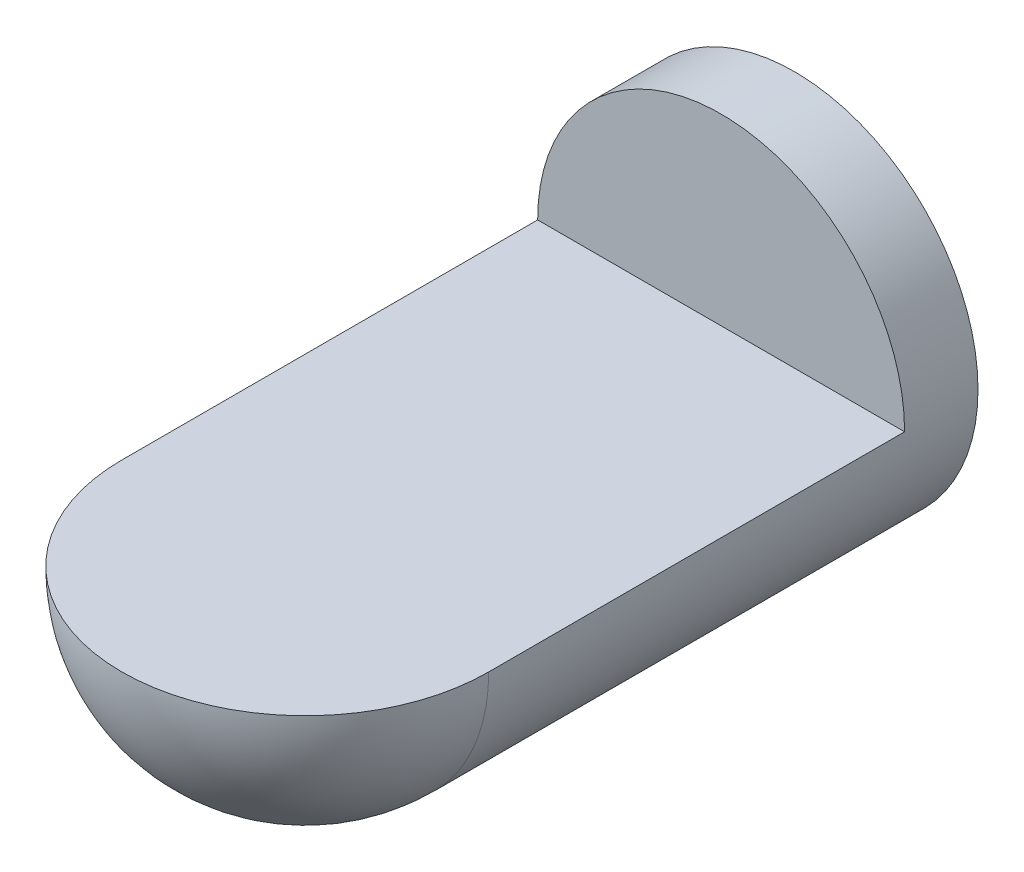
ISO-10303-21;
HEADER;
FILE_DESCRIPTION(('STEP AP214'),'2;1');
FILE_NAME('part.step','',(''),(''),'','','');
FILE_SCHEMA(('AUTOMOTIVE_DESIGN { 1 0 10303 214 1 1 1 1 }'));
ENDSEC;
DATA;
#1=APPLICATION_CONTEXT('core data for automotive mechanical design processes');
#2=APPLICATION_PROTOCOL_DEFINITION('international standard','automotive_design',2000,#1);
#3=PRODUCT_CONTEXT('',#1,'mechanical');
#4=PRODUCT('Part','Part','',(#3));
#5=PRODUCT_RELATED_PRODUCT_CATEGORY('part','',(#4));
#6=PRODUCT_DEFINITION_FORMATION('','',#4);
#7=PRODUCT_DEFINITION_CONTEXT('part definition',#1,'design');
#8=PRODUCT_DEFINITION('design','',#6,#7);
#9=PRODUCT_DEFINITION_SHAPE('','',#8);
#10=(LENGTH_UNIT() NAMED_UNIT(*) SI_UNIT(.MILLI.,.METRE.));
#11=(NAMED_UNIT(*) PLANE_ANGLE_UNIT() SI_UNIT($,.RADIAN.));
#12=(NAMED_UNIT(*) SI_UNIT($,.STERADIAN.) SOLID_ANGLE_UNIT());
#13=UNCERTAINTY_MEASURE_WITH_UNIT(LENGTH_MEASURE(1.E-05),#10,'distance_accuracy_value','');
#14=(GEOMETRIC_REPRESENTATION_CONTEXT(3) GLOBAL_UNCERTAINTY_ASSIGNED_CONTEXT((#13)) GLOBAL_UNIT_ASSIGNED_CONTEXT((#10,
#11,#12)) REPRESENTATION_CONTEXT('',''));
#15=CARTESIAN_POINT('',(0.,0.,0.));
#16=DIRECTION('',(0.,0.,1.));
#17=DIRECTION('',(1.,0.,0.));
#18=AXIS2_PLACEMENT_3D('',#15,#16,#17);
#19=CARTESIAN_POINT('',(0.,0.,0.));
#20=DIRECTION('',(0.,0.,1.));
#21=DIRECTION('',(0.,1.,0.));
#22=AXIS2_PLACEMENT_3D('',#19,#20,#21);
#23=SPHERICAL_SURFACE('',#22,75.);
#24=CARTESIAN_POINT('',(0.,0.,0.));
#25=DIRECTION('',(0.,1.,0.));
#26=DIRECTION('',(0.,0.,1.));
#27=AXIS2_PLACEMENT_3D('',#24,#25,#26);
#28=CIRCLE('',#27,75.);
#29=CARTESIAN_POINT('',(-75.,0.,0.));
#30=VERTEX_POINT('',#29);
#31=CARTESIAN_POINT('',(75.,0.,0.));
#32=VERTEX_POINT('',#31);
#33=EDGE_CURVE('E52',#30,#32,#28,.T.);
#34=ORIENTED_EDGE('',*,*,#33,.F.);
#35=CARTESIAN_POINT('',(0.,0.,0.));
#36=DIRECTION('',(0.,0.,1.));
#37=DIRECTION('',(1.,0.,0.));
#38=AXIS2_PLACEMENT_3D('',#35,#36,#37);
#39=CIRCLE('',#38,75.);
#40=EDGE_CURVE('E73',#30,#32,#39,.T.);
#41=ORIENTED_EDGE('',*,*,#40,.T.);
#42=EDGE_LOOP('',(#34,#41));
#43=FACE_BOUND('',#42,.T.);
#44=ADVANCED_FACE('F33',(#43),#23,.T.);
#45=CARTESIAN_POINT('',(0.,0.,146.909145290857));
#46=DIRECTION('',(0.,0.,1.));
#47=DIRECTION('',(1.,0.,0.));
#48=AXIS2_PLACEMENT_3D('',#45,#46,#47);
#49=CYLINDRICAL_SURFACE('',#48,75.);
#50=CARTESIAN_POINT('',(0.,0.,-200.));
#51=DIRECTION('',(0.,0.,1.));
#52=DIRECTION('',(1.,0.,0.));
#53=AXIS2_PLACEMENT_3D('',#50,#51,#52);
#54=CIRCLE('',#53,75.);
#55=CARTESIAN_POINT('',(75.,0.,-200.));
#56=VERTEX_POINT('',#55);
#57=EDGE_CURVE('E68',#56,#56,#54,.T.);
#58=ORIENTED_EDGE('',*,*,#57,.T.);
#59=EDGE_LOOP('',(#58));
#60=FACE_BOUND('',#59,.T.);
#61=DIRECTION('',(0.,0.,1.));
#62=VECTOR('',#61,1.);
#63=CARTESIAN_POINT('',(75.,0.,146.909145290857));
#64=LINE('',#63,#62);
#65=CARTESIAN_POINT('',(75.,0.,-170.));
#66=VERTEX_POINT('',#65);
#67=EDGE_CURVE('E11',#32,#66,#64,.F.);
#68=ORIENTED_EDGE('',*,*,#67,.F.);
#69=ORIENTED_EDGE('',*,*,#40,.F.);
#70=DIRECTION('',(0.,0.,1.));
#71=VECTOR('',#70,1.);
#72=CARTESIAN_POINT('',(-75.,0.,146.909145290857));
#73=LINE('',#72,#71);
#74=CARTESIAN_POINT('',(-75.,0.,-170.));
#75=VERTEX_POINT('',#74);
#76=EDGE_CURVE('E63',#75,#30,#73,.T.);
#77=ORIENTED_EDGE('',*,*,#76,.F.);
#78=CARTESIAN_POINT('',(0.,0.,-170.));
#79=DIRECTION('',(0.,0.,1.));
#80=DIRECTION('',(1.,0.,0.));
#81=AXIS2_PLACEMENT_3D('',#78,#79,#80);
#82=CIRCLE('',#81,75.);
#83=EDGE_CURVE('E41',#66,#75,#82,.T.);
#84=ORIENTED_EDGE('',*,*,#83,.F.);
#85=EDGE_LOOP('',(#68,#69,#77,#84));
#86=FACE_BOUND('',#85,.T.);
#87=ADVANCED_FACE('F60',(#60,#86),#49,.T.);
#88=CARTESIAN_POINT('',(0.,0.,-200.));
#89=DIRECTION('',(0.,0.,1.));
#90=DIRECTION('',(1.,0.,0.));
#91=AXIS2_PLACEMENT_3D('',#88,#89,#90);
#92=PLANE('',#91);
#93=ORIENTED_EDGE('',*,*,#57,.F.);
#94=EDGE_LOOP('',(#93));
#95=FACE_BOUND('',#94,.T.);
#96=ADVANCED_FACE('F35',(#95),#92,.F.);
#97=CARTESIAN_POINT('',(75.,0.,-170.));
#98=DIRECTION('',(0.,1.,0.));
#99=DIRECTION('',(0.,0.,1.));
#100=AXIS2_PLACEMENT_3D('',#97,#98,#99);
#101=PLANE('',#100);
#102=ORIENTED_EDGE('',*,*,#33,.T.);
#103=ORIENTED_EDGE('',*,*,#67,.T.);
#104=DIRECTION('',(-1.,0.,0.));
#105=VECTOR('',#104,1.);
#106=CARTESIAN_POINT('',(75.,0.,-170.));
#107=LINE('',#106,#105);
#108=EDGE_CURVE('E47',#66,#75,#107,.T.);
#109=ORIENTED_EDGE('',*,*,#108,.T.);
#110=ORIENTED_EDGE('',*,*,#76,.T.);
#111=EDGE_LOOP('',(#102,#103,#109,#110));
#112=FACE_BOUND('',#111,.T.);
#113=ADVANCED_FACE('F65',(#112),#101,.T.);
#114=CARTESIAN_POINT('',(75.,0.,-170.));
#115=DIRECTION('',(0.,0.,1.));
#116=DIRECTION('',(1.,0.,0.));
#117=AXIS2_PLACEMENT_3D('',#114,#115,#116);
#118=PLANE('',#117);
#119=ORIENTED_EDGE('',*,*,#108,.F.);
#120=ORIENTED_EDGE('',*,*,#83,.T.);
#121=EDGE_LOOP('',(#119,#120));
#122=FACE_BOUND('',#121,.T.);
#123=ADVANCED_FACE('F66',(#122),#118,.T.);
#124=CLOSED_SHELL('',(#44,#87,#96,#113,#123));
#125=MANIFOLD_SOLID_BREP('B2',#124);
#126=ADVANCED_BREP_SHAPE_REPRESENTATION('',(#18,#125),#14);
#127=SHAPE_DEFINITION_REPRESENTATION(#9,#126);
ENDSEC;
END-ISO-10303-21;
